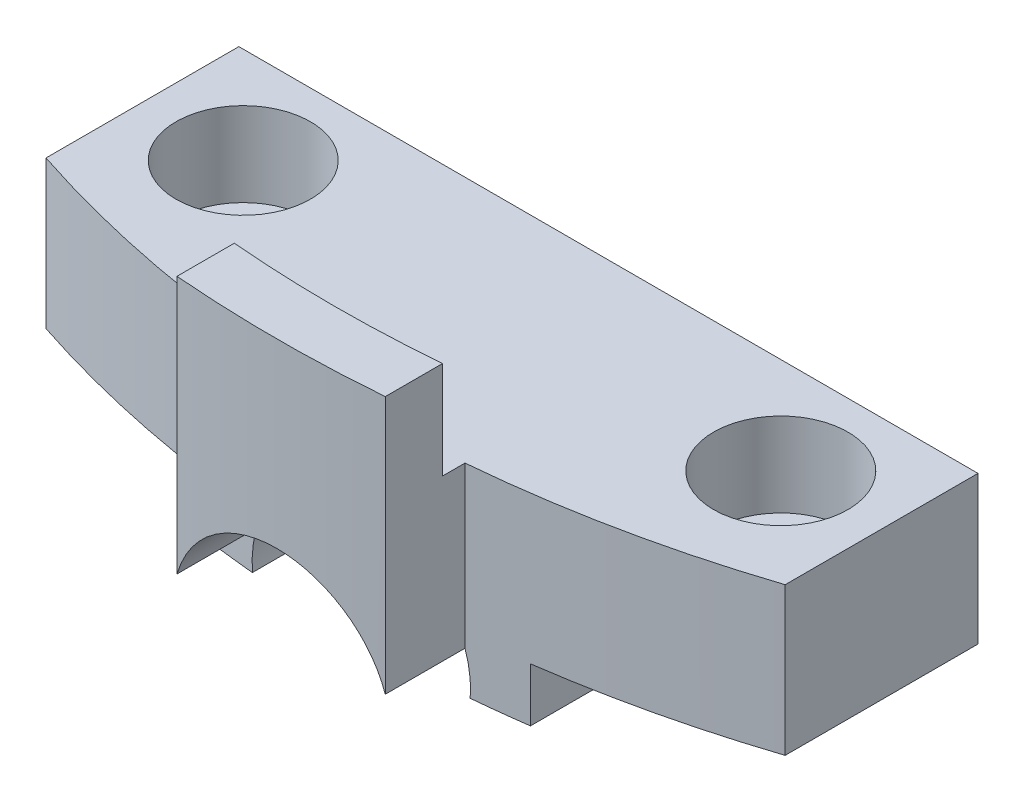
ISO-10303-21;
HEADER;
FILE_DESCRIPTION(('STEP AP214'),'2;1');
FILE_NAME('part.step','',(''),(''),'','','');
FILE_SCHEMA(('AUTOMOTIVE_DESIGN { 1 0 10303 214 1 1 1 1 }'));
ENDSEC;
DATA;
#1=APPLICATION_CONTEXT('core data for automotive mechanical design processes');
#2=APPLICATION_PROTOCOL_DEFINITION('international standard','automotive_design',2000,#1);
#3=PRODUCT_CONTEXT('',#1,'mechanical');
#4=PRODUCT('Part','Part','',(#3));
#5=PRODUCT_RELATED_PRODUCT_CATEGORY('part','',(#4));
#6=PRODUCT_DEFINITION_FORMATION('','',#4);
#7=PRODUCT_DEFINITION_CONTEXT('part definition',#1,'design');
#8=PRODUCT_DEFINITION('design','',#6,#7);
#9=PRODUCT_DEFINITION_SHAPE('','',#8);
#10=(LENGTH_UNIT() NAMED_UNIT(*) SI_UNIT(.MILLI.,.METRE.));
#11=(NAMED_UNIT(*) PLANE_ANGLE_UNIT() SI_UNIT($,.RADIAN.));
#12=(NAMED_UNIT(*) SI_UNIT($,.STERADIAN.) SOLID_ANGLE_UNIT());
#13=UNCERTAINTY_MEASURE_WITH_UNIT(LENGTH_MEASURE(1.E-05),#10,'distance_accuracy_value','');
#14=(GEOMETRIC_REPRESENTATION_CONTEXT(3) GLOBAL_UNCERTAINTY_ASSIGNED_CONTEXT((#13)) GLOBAL_UNIT_ASSIGNED_CONTEXT((#10,
#11,#12)) REPRESENTATION_CONTEXT('',''));
#15=CARTESIAN_POINT('',(0.,0.,0.));
#16=DIRECTION('',(0.,0.,1.));
#17=DIRECTION('',(1.,0.,0.));
#18=AXIS2_PLACEMENT_3D('',#15,#16,#17);
#19=CARTESIAN_POINT('',(0.,-1.6,0.));
#20=DIRECTION('',(0.,-1.,0.));
#21=DIRECTION('',(0.,0.,-1.));
#22=AXIS2_PLACEMENT_3D('',#19,#20,#21);
#23=PLANE('',#22);
#24=DIRECTION('',(0.,0.,-1.));
#25=VECTOR('',#24,1.);
#26=CARTESIAN_POINT('',(-3.24037034920393,-1.6,37.5));
#27=LINE('',#26,#25);
#28=CARTESIAN_POINT('',(-3.24037034920393,-1.6,34.9862615322072));
#29=VERTEX_POINT('',#28);
#30=CARTESIAN_POINT('',(-3.24037034920393,-1.6,27.630275757807));
#31=VERTEX_POINT('',#30);
#32=EDGE_CURVE('E11',#29,#31,#27,.T.);
#33=ORIENTED_EDGE('',*,*,#32,.F.);
#34=CARTESIAN_POINT('',(0.,-1.6,0.));
#35=DIRECTION('',(0.,-1.,0.));
#36=DIRECTION('',(0.,0.,-1.));
#37=AXIS2_PLACEMENT_3D('',#34,#35,#36);
#38=CIRCLE('',#37,35.136);
#39=CARTESIAN_POINT('',(-4.85,-1.6,34.7996551132335));
#40=VERTEX_POINT('',#39);
#41=EDGE_CURVE('E179',#29,#40,#38,.T.);
#42=ORIENTED_EDGE('',*,*,#41,.T.);
#43=DIRECTION('',(0.,0.,-1.));
#44=VECTOR('',#43,1.);
#45=CARTESIAN_POINT('',(-4.85,-1.6,34.7996551132335));
#46=LINE('',#45,#44);
#47=CARTESIAN_POINT('',(-4.85,-1.6,27.630275757807));
#48=VERTEX_POINT('',#47);
#49=EDGE_CURVE('E163',#40,#48,#46,.T.);
#50=ORIENTED_EDGE('',*,*,#49,.T.);
#51=DIRECTION('',(1.,0.,0.));
#52=VECTOR('',#51,1.);
#53=CARTESIAN_POINT('',(-4.85,-1.6,27.630275757807));
#54=LINE('',#53,#52);
#55=EDGE_CURVE('E157',#48,#31,#54,.T.);
#56=ORIENTED_EDGE('',*,*,#55,.T.);
#57=EDGE_LOOP('',(#33,#42,#50,#56));
#58=FACE_BOUND('',#57,.T.);
#59=ADVANCED_FACE('F36',(#58),#23,.T.);
#60=CARTESIAN_POINT('',(0.,0.,0.));
#61=DIRECTION('',(0.,-1.,0.));
#62=DIRECTION('',(0.,0.,-1.));
#63=AXIS2_PLACEMENT_3D('',#60,#61,#62);
#64=PLANE('',#63);
#65=DIRECTION('',(0.,0.,1.));
#66=VECTOR('',#65,1.);
#67=CARTESIAN_POINT('',(4.85,0.,34.7996551132335));
#68=LINE('',#67,#66);
#69=CARTESIAN_POINT('',(4.85,0.,27.630275757807));
#70=VERTEX_POINT('',#69);
#71=CARTESIAN_POINT('',(4.85,0.,34.7996551132335));
#72=VERTEX_POINT('',#71);
#73=EDGE_CURVE('E176',#70,#72,#68,.T.);
#74=ORIENTED_EDGE('',*,*,#73,.F.);
#75=DIRECTION('',(-1.,0.,0.));
#76=VECTOR('',#75,1.);
#77=CARTESIAN_POINT('',(-11.,0.,27.630275757807));
#78=LINE('',#77,#76);
#79=CARTESIAN_POINT('',(11.,0.,27.630275757807));
#80=VERTEX_POINT('',#79);
#81=EDGE_CURVE('E235',#80,#70,#78,.T.);
#82=ORIENTED_EDGE('',*,*,#81,.F.);
#83=DIRECTION('',(0.,0.,-1.));
#84=VECTOR('',#83,1.);
#85=CARTESIAN_POINT('',(11.,0.,27.630275757807));
#86=LINE('',#85,#84);
#87=CARTESIAN_POINT('',(11.,0.,33.369724242193));
#88=VERTEX_POINT('',#87);
#89=EDGE_CURVE('E254',#88,#80,#86,.T.);
#90=ORIENTED_EDGE('',*,*,#89,.F.);
#91=CARTESIAN_POINT('',(0.,0.,0.));
#92=DIRECTION('',(0.,1.,0.));
#93=DIRECTION('',(0.,0.,-1.));
#94=AXIS2_PLACEMENT_3D('',#91,#92,#93);
#95=CIRCLE('',#94,35.136);
#96=EDGE_CURVE('E252',#72,#88,#95,.T.);
#97=ORIENTED_EDGE('',*,*,#96,.F.);
#98=EDGE_LOOP('',(#74,#82,#90,#97));
#99=FACE_BOUND('',#98,.T.);
#100=CARTESIAN_POINT('',(8.,0.,30.5));
#101=DIRECTION('',(0.,1.,0.));
#102=DIRECTION('',(0.,0.,1.));
#103=AXIS2_PLACEMENT_3D('',#100,#101,#102);
#104=CIRCLE('',#103,1.1);
#105=CARTESIAN_POINT('',(8.,0.,31.6));
#106=VERTEX_POINT('',#105);
#107=EDGE_CURVE('E224',#106,#106,#104,.T.);
#108=ORIENTED_EDGE('',*,*,#107,.T.);
#109=EDGE_LOOP('',(#108));
#110=FACE_BOUND('',#109,.T.);
#111=ADVANCED_FACE('F309',(#99,#110),#64,.T.);
#112=CARTESIAN_POINT('',(-8.,4.4,30.5));
#113=DIRECTION('',(0.,-1.,0.));
#114=DIRECTION('',(0.,0.,-1.));
#115=AXIS2_PLACEMENT_3D('',#112,#113,#114);
#116=CYLINDRICAL_SURFACE('',#115,1.1);
#117=CARTESIAN_POINT('',(-8.,0.,30.5));
#118=DIRECTION('',(0.,1.,0.));
#119=DIRECTION('',(0.,0.,1.));
#120=AXIS2_PLACEMENT_3D('',#117,#118,#119);
#121=CIRCLE('',#120,1.1);
#122=CARTESIAN_POINT('',(-8.,0.,31.6));
#123=VERTEX_POINT('',#122);
#124=EDGE_CURVE('E227',#123,#123,#121,.T.);
#125=ORIENTED_EDGE('',*,*,#124,.F.);
#126=EDGE_LOOP('',(#125));
#127=FACE_BOUND('',#126,.T.);
#128=CARTESIAN_POINT('',(-8.,1.9,30.5));
#129=DIRECTION('',(0.,1.,0.));
#130=DIRECTION('',(0.,0.,1.));
#131=AXIS2_PLACEMENT_3D('',#128,#129,#130);
#132=CIRCLE('',#131,1.1);
#133=CARTESIAN_POINT('',(-8.,1.9,31.6));
#134=VERTEX_POINT('',#133);
#135=EDGE_CURVE('E218',#134,#134,#132,.T.);
#136=ORIENTED_EDGE('',*,*,#135,.T.);
#137=EDGE_LOOP('',(#136));
#138=FACE_BOUND('',#137,.T.);
#139=ADVANCED_FACE('F368',(#127,#138),#116,.F.);
#140=CARTESIAN_POINT('',(8.,4.4,30.5));
#141=DIRECTION('',(0.,-1.,0.));
#142=DIRECTION('',(0.,0.,-1.));
#143=AXIS2_PLACEMENT_3D('',#140,#141,#142);
#144=CYLINDRICAL_SURFACE('',#143,1.1);
#145=ORIENTED_EDGE('',*,*,#107,.F.);
#146=EDGE_LOOP('',(#145));
#147=FACE_BOUND('',#146,.T.);
#148=CARTESIAN_POINT('',(8.,1.9,30.5));
#149=DIRECTION('',(0.,1.,0.));
#150=DIRECTION('',(0.,0.,1.));
#151=AXIS2_PLACEMENT_3D('',#148,#149,#150);
#152=CIRCLE('',#151,1.1);
#153=CARTESIAN_POINT('',(8.,1.9,31.6));
#154=VERTEX_POINT('',#153);
#155=EDGE_CURVE('E194',#154,#154,#152,.T.);
#156=ORIENTED_EDGE('',*,*,#155,.T.);
#157=EDGE_LOOP('',(#156));
#158=FACE_BOUND('',#157,.T.);
#159=ADVANCED_FACE('F406',(#147,#158),#144,.F.);
#160=CARTESIAN_POINT('',(0.,4.4,0.));
#161=DIRECTION('',(0.,-1.,0.));
#162=DIRECTION('',(0.,0.,-1.));
#163=AXIS2_PLACEMENT_3D('',#160,#161,#162);
#164=PLANE('',#163);
#165=CARTESIAN_POINT('',(-8.,4.4,30.5));
#166=DIRECTION('',(0.,1.,0.));
#167=DIRECTION('',(0.,0.,1.));
#168=AXIS2_PLACEMENT_3D('',#165,#166,#167);
#169=CIRCLE('',#168,2.);
#170=CARTESIAN_POINT('',(-8.,4.4,32.5));
#171=VERTEX_POINT('',#170);
#172=EDGE_CURVE('E195',#171,#171,#169,.T.);
#173=ORIENTED_EDGE('',*,*,#172,.F.);
#174=EDGE_LOOP('',(#173));
#175=FACE_BOUND('',#174,.T.);
#176=CARTESIAN_POINT('',(8.,4.4,30.5));
#177=DIRECTION('',(0.,1.,0.));
#178=DIRECTION('',(0.,0.,1.));
#179=AXIS2_PLACEMENT_3D('',#176,#177,#178);
#180=CIRCLE('',#179,2.);
#181=CARTESIAN_POINT('',(8.,4.4,32.5));
#182=VERTEX_POINT('',#181);
#183=EDGE_CURVE('E190',#182,#182,#180,.T.);
#184=ORIENTED_EDGE('',*,*,#183,.F.);
#185=EDGE_LOOP('',(#184));
#186=FACE_BOUND('',#185,.T.);
#187=CARTESIAN_POINT('',(0.,4.4,0.));
#188=DIRECTION('',(0.,-1.,0.));
#189=DIRECTION('',(0.,0.,1.));
#190=AXIS2_PLACEMENT_3D('',#187,#188,#189);
#191=CIRCLE('',#190,35.8);
#192=CARTESIAN_POINT('',(3.1,4.4,35.6655295768898));
#193=VERTEX_POINT('',#192);
#194=CARTESIAN_POINT('',(-3.1,4.4,35.6655295768898));
#195=VERTEX_POINT('',#194);
#196=EDGE_CURVE('E207',#193,#195,#191,.T.);
#197=ORIENTED_EDGE('',*,*,#196,.F.);
#198=DIRECTION('',(0.,0.,-1.));
#199=VECTOR('',#198,1.);
#200=CARTESIAN_POINT('',(3.1,4.4,37.3716470067884));
#201=LINE('',#200,#199);
#202=CARTESIAN_POINT('',(3.09999999999999,4.4,34.9989784993791));
#203=VERTEX_POINT('',#202);
#204=EDGE_CURVE('E239',#193,#203,#201,.T.);
#205=ORIENTED_EDGE('',*,*,#204,.T.);
#206=CARTESIAN_POINT('',(0.,4.4,0.));
#207=DIRECTION('',(0.,1.,0.));
#208=DIRECTION('',(0.,0.,-1.));
#209=AXIS2_PLACEMENT_3D('',#206,#207,#208);
#210=CIRCLE('',#209,35.136);
#211=CARTESIAN_POINT('',(11.,4.4,33.369724242193));
#212=VERTEX_POINT('',#211);
#213=EDGE_CURVE('E241',#203,#212,#210,.T.);
#214=ORIENTED_EDGE('',*,*,#213,.T.);
#215=DIRECTION('',(0.,0.,-1.));
#216=VECTOR('',#215,1.);
#217=CARTESIAN_POINT('',(11.,4.4,27.630275757807));
#218=LINE('',#217,#216);
#219=CARTESIAN_POINT('',(11.,4.4,27.630275757807));
#220=VERTEX_POINT('',#219);
#221=EDGE_CURVE('E243',#212,#220,#218,.T.);
#222=ORIENTED_EDGE('',*,*,#221,.T.);
#223=DIRECTION('',(-1.,0.,0.));
#224=VECTOR('',#223,1.);
#225=CARTESIAN_POINT('',(-11.,4.4,27.630275757807));
#226=LINE('',#225,#224);
#227=CARTESIAN_POINT('',(-11.,4.4,27.630275757807));
#228=VERTEX_POINT('',#227);
#229=EDGE_CURVE('E245',#220,#228,#226,.T.);
#230=ORIENTED_EDGE('',*,*,#229,.T.);
#231=DIRECTION('',(0.,0.,1.));
#232=VECTOR('',#231,1.);
#233=CARTESIAN_POINT('',(-11.,4.4,27.630275757807));
#234=LINE('',#233,#232);
#235=CARTESIAN_POINT('',(-11.,4.4,33.369724242193));
#236=VERTEX_POINT('',#235);
#237=EDGE_CURVE('E231',#228,#236,#234,.T.);
#238=ORIENTED_EDGE('',*,*,#237,.T.);
#239=CARTESIAN_POINT('',(0.,4.4,0.));
#240=DIRECTION('',(0.,1.,0.));
#241=DIRECTION('',(0.,0.,-1.));
#242=AXIS2_PLACEMENT_3D('',#239,#240,#241);
#243=CIRCLE('',#242,35.136);
#244=CARTESIAN_POINT('',(-3.1,4.4,34.9989784993791));
#245=VERTEX_POINT('',#244);
#246=EDGE_CURVE('E234',#236,#245,#243,.T.);
#247=ORIENTED_EDGE('',*,*,#246,.T.);
#248=DIRECTION('',(0.,0.,1.));
#249=VECTOR('',#248,1.);
#250=CARTESIAN_POINT('',(-3.1,4.4,37.3716470067884));
#251=LINE('',#250,#249);
#252=EDGE_CURVE('E237',#245,#195,#251,.T.);
#253=ORIENTED_EDGE('',*,*,#252,.T.);
#254=EDGE_LOOP('',(#197,#205,#214,#222,#230,#238,#247,#253));
#255=FACE_BOUND('',#254,.T.);
#256=ADVANCED_FACE('F315',(#175,#186,#255),#164,.F.);
#257=DIRECTION('',(0.,0.,-1.));
#258=VECTOR('',#257,1.);
#259=CARTESIAN_POINT('',(-4.85,0.,34.7996551132335));
#260=LINE('',#259,#258);
#261=CARTESIAN_POINT('',(-4.85,0.,34.7996551132335));
#262=VERTEX_POINT('',#261);
#263=CARTESIAN_POINT('',(-4.85,0.,27.630275757807));
#264=VERTEX_POINT('',#263);
#265=EDGE_CURVE('E58',#262,#264,#260,.T.);
#266=ORIENTED_EDGE('',*,*,#265,.F.);
#267=CARTESIAN_POINT('',(0.,0.,0.));
#268=DIRECTION('',(0.,1.,0.));
#269=DIRECTION('',(0.,0.,-1.));
#270=AXIS2_PLACEMENT_3D('',#267,#268,#269);
#271=CIRCLE('',#270,35.136);
#272=CARTESIAN_POINT('',(-11.,0.,33.369724242193));
#273=VERTEX_POINT('',#272);
#274=EDGE_CURVE('E250',#273,#262,#271,.T.);
#275=ORIENTED_EDGE('',*,*,#274,.F.);
#276=DIRECTION('',(0.,0.,1.));
#277=VECTOR('',#276,1.);
#278=CARTESIAN_POINT('',(-11.,0.,27.630275757807));
#279=LINE('',#278,#277);
#280=CARTESIAN_POINT('',(-11.,0.,27.630275757807));
#281=VERTEX_POINT('',#280);
#282=EDGE_CURVE('E230',#281,#273,#279,.T.);
#283=ORIENTED_EDGE('',*,*,#282,.F.);
#284=EDGE_CURVE('E256',#264,#281,#78,.T.);
#285=ORIENTED_EDGE('',*,*,#284,.F.);
#286=EDGE_LOOP('',(#266,#275,#283,#285));
#287=FACE_BOUND('',#286,.T.);
#288=ORIENTED_EDGE('',*,*,#124,.T.);
#289=EDGE_LOOP('',(#288));
#290=FACE_BOUND('',#289,.T.);
#291=ADVANCED_FACE('F370',(#287,#290),#64,.T.);
#292=CARTESIAN_POINT('',(-11.,4.4,27.630275757807));
#293=DIRECTION('',(1.,0.,0.));
#294=DIRECTION('',(0.,0.,-1.));
#295=AXIS2_PLACEMENT_3D('',#292,#293,#294);
#296=PLANE('',#295);
#297=ORIENTED_EDGE('',*,*,#282,.T.);
#298=DIRECTION('',(0.,-1.,0.));
#299=VECTOR('',#298,1.);
#300=CARTESIAN_POINT('',(-11.,4.4,33.369724242193));
#301=LINE('',#300,#299);
#302=EDGE_CURVE('E279',#236,#273,#301,.T.);
#303=ORIENTED_EDGE('',*,*,#302,.F.);
#304=ORIENTED_EDGE('',*,*,#237,.F.);
#305=DIRECTION('',(0.,-1.,0.));
#306=VECTOR('',#305,1.);
#307=CARTESIAN_POINT('',(-11.,4.4,27.630275757807));
#308=LINE('',#307,#306);
#309=EDGE_CURVE('E247',#228,#281,#308,.T.);
#310=ORIENTED_EDGE('',*,*,#309,.T.);
#311=EDGE_LOOP('',(#297,#303,#304,#310));
#312=FACE_BOUND('',#311,.T.);
#313=ADVANCED_FACE('F38',(#312),#296,.F.);
#314=CARTESIAN_POINT('',(0.,4.4,0.));
#315=DIRECTION('',(0.,-1.,0.));
#316=DIRECTION('',(0.,0.,-1.));
#317=AXIS2_PLACEMENT_3D('',#314,#315,#316);
#318=CYLINDRICAL_SURFACE('',#317,35.136);
#319=ORIENTED_EDGE('',*,*,#41,.F.);
#320=CARTESIAN_POINT('',(-3.24037034920393,-1.6,34.9862615322072));
#321=CARTESIAN_POINT('',(-3.24838147449118,-1.49636718346636,34.9855152583489));
#322=CARTESIAN_POINT('',(-3.25138984980575,-1.39234811177976,34.985238156749));
#323=CARTESIAN_POINT('',(-3.24746138088606,-1.18544698879089,34.9856051664634));
#324=CARTESIAN_POINT('',(-3.24061480597139,-1.08256320571821,34.9862409161173));
#325=CARTESIAN_POINT('',(-3.21718022012195,-0.877921141327389,34.9884035445804));
#326=CARTESIAN_POINT('',(-3.20059223316633,-0.776162857239386,34.9899304211961));
#327=CARTESIAN_POINT('',(-3.15765501918185,-0.573765579114489,34.9938296575146));
#328=CARTESIAN_POINT('',(-3.13121753144742,-0.47314545151043,34.9962096544378));
#329=CARTESIAN_POINT('',(-3.09999999999999,-0.374038935202794,34.9989784993791));
#330=B_SPLINE_CURVE_WITH_KNOTS('',3,(#320,#321,#322,#323,#324,#325,#326,#327,#328,#329),
.UNSPECIFIED.,.F.,.F.,(4,2,2,2,4),(0.,0.311707817267455,0.620578559351616,0.929448541132698,
1.24115559652218),.UNSPECIFIED.);
#331=CARTESIAN_POINT('',(-3.1,-0.374038935202841,34.9989784993791));
#332=VERTEX_POINT('',#331);
#333=EDGE_CURVE('E148',#29,#332,#330,.T.);
#334=ORIENTED_EDGE('',*,*,#333,.T.);
#335=DIRECTION('',(0.,-1.,0.));
#336=VECTOR('',#335,1.);
#337=CARTESIAN_POINT('',(-3.1,4.4,34.9989784993791));
#338=LINE('',#337,#336);
#339=EDGE_CURVE('E276',#245,#332,#338,.T.);
#340=ORIENTED_EDGE('',*,*,#339,.F.);
#341=ORIENTED_EDGE('',*,*,#246,.F.);
#342=ORIENTED_EDGE('',*,*,#302,.T.);
#343=ORIENTED_EDGE('',*,*,#274,.T.);
#344=DIRECTION('',(0.,1.,0.));
#345=VECTOR('',#344,1.);
#346=CARTESIAN_POINT('',(-4.85,-1.6,34.7996551132335));
#347=LINE('',#346,#345);
#348=EDGE_CURVE('E187',#40,#262,#347,.T.);
#349=ORIENTED_EDGE('',*,*,#348,.F.);
#350=EDGE_LOOP('',(#319,#334,#340,#341,#342,#343,#349));
#351=FACE_BOUND('',#350,.T.);
#352=ADVANCED_FACE('F353',(#351),#318,.T.);
#353=CARTESIAN_POINT('',(-3.1,4.4,37.3716470067884));
#354=DIRECTION('',(1.,0.,0.));
#355=DIRECTION('',(0.,0.,-1.));
#356=AXIS2_PLACEMENT_3D('',#353,#354,#355);
#357=PLANE('',#356);
#358=ORIENTED_EDGE('',*,*,#339,.T.);
#359=DIRECTION('',(0.,0.,-1.));
#360=VECTOR('',#359,1.);
#361=CARTESIAN_POINT('',(-3.1,-0.374038935202841,37.5));
#362=LINE('',#361,#360);
#363=CARTESIAN_POINT('',(-3.09999999999999,-0.374038935202799,37.3716470067884));
#364=VERTEX_POINT('',#363);
#365=EDGE_CURVE('E324',#332,#364,#362,.F.);
#366=ORIENTED_EDGE('',*,*,#365,.T.);
#367=DIRECTION('',(0.,-1.,0.));
#368=VECTOR('',#367,1.);
#369=CARTESIAN_POINT('',(-3.1,4.4,37.3716470067884));
#370=LINE('',#369,#368);
#371=CARTESIAN_POINT('',(-3.1,7.3,37.3716470067884));
#372=VERTEX_POINT('',#371);
#373=EDGE_CURVE('E273',#372,#364,#370,.T.);
#374=ORIENTED_EDGE('',*,*,#373,.F.);
#375=DIRECTION('',(0.,0.,1.));
#376=VECTOR('',#375,1.);
#377=CARTESIAN_POINT('',(-3.1,7.3,35.6655295768898));
#378=LINE('',#377,#376);
#379=CARTESIAN_POINT('',(-3.1,7.3,35.6655295768898));
#380=VERTEX_POINT('',#379);
#381=EDGE_CURVE('E206',#380,#372,#378,.T.);
#382=ORIENTED_EDGE('',*,*,#381,.F.);
#383=DIRECTION('',(0.,-1.,0.));
#384=VECTOR('',#383,1.);
#385=CARTESIAN_POINT('',(-3.1,7.3,35.6655295768898));
#386=LINE('',#385,#384);
#387=EDGE_CURVE('E221',#380,#195,#386,.T.);
#388=ORIENTED_EDGE('',*,*,#387,.T.);
#389=ORIENTED_EDGE('',*,*,#252,.F.);
#390=EDGE_LOOP('',(#358,#366,#374,#382,#388,#389));
#391=FACE_BOUND('',#390,.T.);
#392=ADVANCED_FACE('F356',(#391),#357,.F.);
#393=CARTESIAN_POINT('',(0.,4.4,0.));
#394=DIRECTION('',(0.,-1.,0.));
#395=DIRECTION('',(0.,0.,-1.));
#396=AXIS2_PLACEMENT_3D('',#393,#394,#395);
#397=CYLINDRICAL_SURFACE('',#396,37.5);
#398=ORIENTED_EDGE('',*,*,#373,.T.);
#399=CARTESIAN_POINT('',(-3.09999999999999,-0.374038935202799,37.3716470067884));
#400=CARTESIAN_POINT('',(-3.07254779406441,-0.286811822106101,37.3739224755368));
#401=CARTESIAN_POINT('',(-3.04140114829006,-0.200760202351265,37.3764773334932));
#402=CARTESIAN_POINT('',(-2.97198147028764,-0.031603381057832,37.3820621753399));
#403=CARTESIAN_POINT('',(-2.93370890431418,0.0515020128313894,37.3850921281422));
#404=CARTESIAN_POINT('',(-2.85032758385757,0.214121346343119,37.3915414008008));
#405=CARTESIAN_POINT('',(-2.80522399196994,0.293637939812438,37.3949604261316));
#406=CARTESIAN_POINT('',(-2.70850812387896,0.448564575219114,37.4020900381524));
#407=CARTESIAN_POINT('',(-2.65689589388932,0.52397464630884,37.4058006227721));
#408=CARTESIAN_POINT('',(-2.49276557621703,0.743297340588614,37.4172170773112));
#409=CARTESIAN_POINT('',(-2.37091198372302,0.880383928116417,37.4252110385129));
#410=CARTESIAN_POINT('',(-2.10600678764599,1.1320674826719,37.4410510447975));
#411=CARTESIAN_POINT('',(-1.96295872366116,1.24666819755547,37.4488971143331));
#412=CARTESIAN_POINT('',(-1.65941673182277,1.45040471797345,37.4635744507601));
#413=CARTESIAN_POINT('',(-1.49890158319284,1.53950906024902,37.4704044588576));
#414=CARTESIAN_POINT('',(-1.16510253025829,1.68949440456298,37.4822678222393));
#415=CARTESIAN_POINT('',(-0.991816975509129,1.75037175111095,37.4873009448013));
#416=CARTESIAN_POINT('',(-0.637830685899814,1.84202434952438,37.4949919566228));
#417=CARTESIAN_POINT('',(-0.457147831971588,1.8728681848497,37.4976552563203));
#418=CARTESIAN_POINT('',(-0.0931627251724879,1.90379440409058,37.5003257717897));
#419=CARTESIAN_POINT('',(0.0901393048123696,1.90387939010773,37.5003332122389));
#420=CARTESIAN_POINT('',(0.453612397954125,1.87333716914913,37.4976956572453));
#421=CARTESIAN_POINT('',(0.633790955269817,1.84279837343865,37.4950582973752));
#422=CARTESIAN_POINT('',(0.986454665277773,1.75202522449514,37.4874383544059));
#423=CARTESIAN_POINT('',(1.15893969720728,1.69179040531208,37.482455734508));
#424=CARTESIAN_POINT('',(1.49149911547903,1.54328955461882,37.4706974624996));
#425=CARTESIAN_POINT('',(1.65156253465671,1.45499909509753,37.463920248699));
#426=CARTESIAN_POINT('',(1.95465299781571,1.2528849210708,37.4493309792825));
#427=CARTESIAN_POINT('',(2.09767715540833,1.13905688998304,37.4415187488107));
#428=CARTESIAN_POINT('',(2.36314468440859,0.88863484205875,37.425704179863));
#429=CARTESIAN_POINT('',(2.48550938051013,0.751957573689869,37.4177012414678));
#430=CARTESIAN_POINT('',(2.70549164357445,0.460012323993601,37.4024398189215));
#431=CARTESIAN_POINT('',(2.80313187949867,0.304761565779923,37.3951806564923));
#432=CARTESIAN_POINT('',(2.92987381825662,0.0596395134927391,37.3853939928706));
#433=CARTESIAN_POINT('',(2.96914764656425,-0.0250934252473997,37.382288122178));
#434=CARTESIAN_POINT('',(3.04020927797019,-0.197482628681803,37.3765750960585));
#435=CARTESIAN_POINT('',(3.07201022161347,-0.285133447784629,37.3739670667517));
#436=CARTESIAN_POINT('',(3.1,-0.374038935202827,37.3716470067884));
#437=B_SPLINE_CURVE_WITH_KNOTS('',3,(#399,#400,#401,#402,#403,#404,#405,#406,#407,#408,#409,
#410,#411,#412,#413,#414,#415,#416,#417,#418,#419,#420,#421,#422,#423,#424,#425,#426,#427,#428,
#429,#430,#431,#432,#433,#434,#435,#436),.UNSPECIFIED.,.F.,.F.,(4,2,2,2,2,2,2,2,2,2,2,2,2,2,2,2,
2,2,4),(0.,0.274329298979116,0.548640654679056,0.822745722729152,1.09684884464251,
1.64478351681073,2.19262678367981,2.74114321773539,3.28973066667867,3.8370624222524,
4.38434787527598,4.93005784377367,5.47577637509011,6.02197137084923,6.56825875888399,
7.11658175710863,7.66440018252418,7.94442922613324,8.22396211059117),.UNSPECIFIED.);
#438=CARTESIAN_POINT('',(3.1,-0.374038935202841,37.3716470067884));
#439=VERTEX_POINT('',#438);
#440=EDGE_CURVE('E322',#364,#439,#437,.T.);
#441=ORIENTED_EDGE('',*,*,#440,.T.);
#442=DIRECTION('',(0.,-1.,0.));
#443=VECTOR('',#442,1.);
#444=CARTESIAN_POINT('',(3.1,4.4,37.3716470067884));
#445=LINE('',#444,#443);
#446=CARTESIAN_POINT('',(3.09999999999999,7.3,37.3716470067884));
#447=VERTEX_POINT('',#446);
#448=EDGE_CURVE('E270',#447,#439,#445,.T.);
#449=ORIENTED_EDGE('',*,*,#448,.F.);
#450=CARTESIAN_POINT('',(0.,7.3,0.));
#451=DIRECTION('',(0.,1.,0.));
#452=DIRECTION('',(0.,0.,1.));
#453=AXIS2_PLACEMENT_3D('',#450,#451,#452);
#454=CIRCLE('',#453,37.5);
#455=EDGE_CURVE('E210',#372,#447,#454,.T.);
#456=ORIENTED_EDGE('',*,*,#455,.F.);
#457=EDGE_LOOP('',(#398,#441,#449,#456));
#458=FACE_BOUND('',#457,.T.);
#459=ADVANCED_FACE('F339',(#458),#397,.T.);
#460=CARTESIAN_POINT('',(3.1,4.4,37.3716470067884));
#461=DIRECTION('',(-1.,0.,0.));
#462=DIRECTION('',(0.,0.,1.));
#463=AXIS2_PLACEMENT_3D('',#460,#461,#462);
#464=PLANE('',#463);
#465=ORIENTED_EDGE('',*,*,#448,.T.);
#466=DIRECTION('',(0.,0.,-1.));
#467=VECTOR('',#466,1.);
#468=CARTESIAN_POINT('',(3.1,-0.374038935202841,37.5));
#469=LINE('',#468,#467);
#470=CARTESIAN_POINT('',(3.09999999999999,-0.374038935202823,34.9989784993791));
#471=VERTEX_POINT('',#470);
#472=EDGE_CURVE('E294',#439,#471,#469,.T.);
#473=ORIENTED_EDGE('',*,*,#472,.T.);
#474=DIRECTION('',(0.,-1.,0.));
#475=VECTOR('',#474,1.);
#476=CARTESIAN_POINT('',(3.09999999999999,4.4,34.9989784993791));
#477=LINE('',#476,#475);
#478=EDGE_CURVE('E267',#203,#471,#477,.T.);
#479=ORIENTED_EDGE('',*,*,#478,.F.);
#480=ORIENTED_EDGE('',*,*,#204,.F.);
#481=DIRECTION('',(0.,-1.,0.));
#482=VECTOR('',#481,1.);
#483=CARTESIAN_POINT('',(3.1,7.3,35.6655295768898));
#484=LINE('',#483,#482);
#485=CARTESIAN_POINT('',(3.1,7.3,35.6655295768898));
#486=VERTEX_POINT('',#485);
#487=EDGE_CURVE('E215',#486,#193,#484,.T.);
#488=ORIENTED_EDGE('',*,*,#487,.F.);
#489=DIRECTION('',(0.,0.,-1.));
#490=VECTOR('',#489,1.);
#491=CARTESIAN_POINT('',(3.1,7.3,37.3716470067884));
#492=LINE('',#491,#490);
#493=EDGE_CURVE('E213',#447,#486,#492,.T.);
#494=ORIENTED_EDGE('',*,*,#493,.F.);
#495=EDGE_LOOP('',(#465,#473,#479,#480,#488,#494));
#496=FACE_BOUND('',#495,.T.);
#497=ADVANCED_FACE('F320',(#496),#464,.F.);
#498=CARTESIAN_POINT('',(0.,4.4,0.));
#499=DIRECTION('',(0.,-1.,0.));
#500=DIRECTION('',(0.,0.,-1.));
#501=AXIS2_PLACEMENT_3D('',#498,#499,#500);
#502=CYLINDRICAL_SURFACE('',#501,35.136);
#503=ORIENTED_EDGE('',*,*,#478,.T.);
#504=CARTESIAN_POINT('',(3.09999999999999,-0.374038935202823,34.9989784993791));
#505=CARTESIAN_POINT('',(3.13121753144742,-0.473145451510457,34.9962096544378));
#506=CARTESIAN_POINT('',(3.15765501918186,-0.573765579114513,34.9938296575146));
#507=CARTESIAN_POINT('',(3.20059223316634,-0.776162857239405,34.9899304211961));
#508=CARTESIAN_POINT('',(3.21718022012195,-0.877921141327406,34.9884035445804));
#509=CARTESIAN_POINT('',(3.24061480597139,-1.08256320571822,34.9862409161173));
#510=CARTESIAN_POINT('',(3.24746138088606,-1.1854469887909,34.9856051664634));
#511=CARTESIAN_POINT('',(3.25138984980575,-1.39234811177977,34.985238156749));
#512=CARTESIAN_POINT('',(3.24838147449118,-1.49636718346636,34.9855152583489));
#513=CARTESIAN_POINT('',(3.24037034920393,-1.6,34.9862615322072));
#514=B_SPLINE_CURVE_WITH_KNOTS('',3,(#504,#505,#506,#507,#508,#509,#510,#511,#512,#513),
.UNSPECIFIED.,.F.,.F.,(4,2,2,2,4),(0.,0.311707055389471,0.620577037170546,0.9294477792547,
1.24115559652215),.UNSPECIFIED.);
#515=CARTESIAN_POINT('',(3.24037034920393,-1.6,34.9862615322072));
#516=VERTEX_POINT('',#515);
#517=EDGE_CURVE('E160',#471,#516,#514,.T.);
#518=ORIENTED_EDGE('',*,*,#517,.T.);
#519=CARTESIAN_POINT('',(0.,-1.6,0.));
#520=DIRECTION('',(0.,-1.,0.));
#521=DIRECTION('',(0.,0.,-1.));
#522=AXIS2_PLACEMENT_3D('',#519,#520,#521);
#523=CIRCLE('',#522,35.136);
#524=CARTESIAN_POINT('',(4.85,-1.6,34.7996551132335));
#525=VERTEX_POINT('',#524);
#526=EDGE_CURVE('E167',#525,#516,#523,.T.);
#527=ORIENTED_EDGE('',*,*,#526,.F.);
#528=DIRECTION('',(0.,1.,0.));
#529=VECTOR('',#528,1.);
#530=CARTESIAN_POINT('',(4.85,-1.6,34.7996551132335));
#531=LINE('',#530,#529);
#532=EDGE_CURVE('E174',#525,#72,#531,.T.);
#533=ORIENTED_EDGE('',*,*,#532,.T.);
#534=ORIENTED_EDGE('',*,*,#96,.T.);
#535=DIRECTION('',(0.,-1.,0.));
#536=VECTOR('',#535,1.);
#537=CARTESIAN_POINT('',(11.,4.4,33.369724242193));
#538=LINE('',#537,#536);
#539=EDGE_CURVE('E264',#212,#88,#538,.T.);
#540=ORIENTED_EDGE('',*,*,#539,.F.);
#541=ORIENTED_EDGE('',*,*,#213,.F.);
#542=EDGE_LOOP('',(#503,#518,#527,#533,#534,#540,#541));
#543=FACE_BOUND('',#542,.T.);
#544=ADVANCED_FACE('F291',(#543),#502,.T.);
#545=CARTESIAN_POINT('',(11.,4.4,27.630275757807));
#546=DIRECTION('',(-1.,0.,0.));
#547=DIRECTION('',(0.,0.,1.));
#548=AXIS2_PLACEMENT_3D('',#545,#546,#547);
#549=PLANE('',#548);
#550=ORIENTED_EDGE('',*,*,#89,.T.);
#551=DIRECTION('',(0.,-1.,0.));
#552=VECTOR('',#551,1.);
#553=CARTESIAN_POINT('',(11.,4.4,27.630275757807));
#554=LINE('',#553,#552);
#555=EDGE_CURVE('E261',#220,#80,#554,.T.);
#556=ORIENTED_EDGE('',*,*,#555,.F.);
#557=ORIENTED_EDGE('',*,*,#221,.F.);
#558=ORIENTED_EDGE('',*,*,#539,.T.);
#559=EDGE_LOOP('',(#550,#556,#557,#558));
#560=FACE_BOUND('',#559,.T.);
#561=ADVANCED_FACE('F306',(#560),#549,.F.);
#562=CARTESIAN_POINT('',(-11.,4.4,27.630275757807));
#563=DIRECTION('',(0.,0.,1.));
#564=DIRECTION('',(1.,0.,0.));
#565=AXIS2_PLACEMENT_3D('',#562,#563,#564);
#566=PLANE('',#565);
#567=CARTESIAN_POINT('',(3.24037034920393,-1.6,27.630275757807));
#568=VERTEX_POINT('',#567);
#569=CARTESIAN_POINT('',(4.85,-1.6,27.630275757807));
#570=VERTEX_POINT('',#569);
#571=EDGE_CURVE('E159',#568,#570,#54,.T.);
#572=ORIENTED_EDGE('',*,*,#571,.F.);
#573=CARTESIAN_POINT('',(0.,-1.35,27.630275757807));
#574=DIRECTION('',(0.,0.,-1.));
#575=DIRECTION('',(-1.,0.,0.));
#576=AXIS2_PLACEMENT_3D('',#573,#574,#575);
#577=CIRCLE('',#576,3.25);
#578=EDGE_CURVE('E50',#31,#568,#577,.T.);
#579=ORIENTED_EDGE('',*,*,#578,.F.);
#580=ORIENTED_EDGE('',*,*,#55,.F.);
#581=DIRECTION('',(0.,1.,0.));
#582=VECTOR('',#581,1.);
#583=CARTESIAN_POINT('',(-4.85,-1.6,27.630275757807));
#584=LINE('',#583,#582);
#585=EDGE_CURVE('E185',#48,#264,#584,.T.);
#586=ORIENTED_EDGE('',*,*,#585,.T.);
#587=ORIENTED_EDGE('',*,*,#284,.T.);
#588=ORIENTED_EDGE('',*,*,#309,.F.);
#589=ORIENTED_EDGE('',*,*,#229,.F.);
#590=ORIENTED_EDGE('',*,*,#555,.T.);
#591=ORIENTED_EDGE('',*,*,#81,.T.);
#592=DIRECTION('',(0.,1.,0.));
#593=VECTOR('',#592,1.);
#594=CARTESIAN_POINT('',(4.85,-1.6,27.630275757807));
#595=LINE('',#594,#593);
#596=EDGE_CURVE('E182',#570,#70,#595,.T.);
#597=ORIENTED_EDGE('',*,*,#596,.F.);
#598=EDGE_LOOP('',(#572,#579,#580,#586,#587,#588,#589,#590,#591,#597));
#599=FACE_BOUND('',#598,.T.);
#600=ADVANCED_FACE('F155',(#599),#566,.F.);
#601=CARTESIAN_POINT('',(0.,7.3,0.));
#602=DIRECTION('',(0.,-1.,0.));
#603=DIRECTION('',(0.,0.,-1.));
#604=AXIS2_PLACEMENT_3D('',#601,#602,#603);
#605=CYLINDRICAL_SURFACE('',#604,35.8);
#606=ORIENTED_EDGE('',*,*,#196,.T.);
#607=ORIENTED_EDGE('',*,*,#387,.F.);
#608=CARTESIAN_POINT('',(0.,7.3,0.));
#609=DIRECTION('',(0.,-1.,0.));
#610=DIRECTION('',(0.,0.,1.));
#611=AXIS2_PLACEMENT_3D('',#608,#609,#610);
#612=CIRCLE('',#611,35.8);
#613=EDGE_CURVE('E203',#486,#380,#612,.T.);
#614=ORIENTED_EDGE('',*,*,#613,.F.);
#615=ORIENTED_EDGE('',*,*,#487,.T.);
#616=EDGE_LOOP('',(#606,#607,#614,#615));
#617=FACE_BOUND('',#616,.T.);
#618=ADVANCED_FACE('F401',(#617),#605,.F.);
#619=CARTESIAN_POINT('',(0.,7.3,0.));
#620=DIRECTION('',(0.,1.,0.));
#621=DIRECTION('',(0.,0.,1.));
#622=AXIS2_PLACEMENT_3D('',#619,#620,#621);
#623=PLANE('',#622);
#624=ORIENTED_EDGE('',*,*,#613,.T.);
#625=ORIENTED_EDGE('',*,*,#381,.T.);
#626=ORIENTED_EDGE('',*,*,#455,.T.);
#627=ORIENTED_EDGE('',*,*,#493,.T.);
#628=EDGE_LOOP('',(#624,#625,#626,#627));
#629=FACE_BOUND('',#628,.T.);
#630=ADVANCED_FACE('F397',(#629),#623,.T.);
#631=CARTESIAN_POINT('',(8.,1.9,30.5));
#632=DIRECTION('',(0.,1.,0.));
#633=DIRECTION('',(0.,0.,1.));
#634=AXIS2_PLACEMENT_3D('',#631,#632,#633);
#635=CYLINDRICAL_SURFACE('',#634,2.);
#636=CARTESIAN_POINT('',(8.,1.9,30.5));
#637=DIRECTION('',(0.,1.,0.));
#638=DIRECTION('',(0.,0.,1.));
#639=AXIS2_PLACEMENT_3D('',#636,#637,#638);
#640=CIRCLE('',#639,2.);
#641=CARTESIAN_POINT('',(8.,1.9,32.5));
#642=VERTEX_POINT('',#641);
#643=EDGE_CURVE('E198',#642,#642,#640,.T.);
#644=ORIENTED_EDGE('',*,*,#643,.F.);
#645=EDGE_LOOP('',(#644));
#646=FACE_BOUND('',#645,.T.);
#647=ORIENTED_EDGE('',*,*,#183,.T.);
#648=EDGE_LOOP('',(#647));
#649=FACE_BOUND('',#648,.T.);
#650=ADVANCED_FACE('F393',(#646,#649),#635,.F.);
#651=CARTESIAN_POINT('',(8.,1.9,30.5));
#652=DIRECTION('',(0.,1.,0.));
#653=DIRECTION('',(0.,0.,1.));
#654=AXIS2_PLACEMENT_3D('',#651,#652,#653);
#655=PLANE('',#654);
#656=ORIENTED_EDGE('',*,*,#155,.F.);
#657=EDGE_LOOP('',(#656));
#658=FACE_BOUND('',#657,.T.);
#659=ORIENTED_EDGE('',*,*,#643,.T.);
#660=EDGE_LOOP('',(#659));
#661=FACE_BOUND('',#660,.T.);
#662=ADVANCED_FACE('F389',(#658,#661),#655,.T.);
#663=CARTESIAN_POINT('',(-8.,1.9,30.5));
#664=DIRECTION('',(0.,1.,0.));
#665=DIRECTION('',(0.,0.,1.));
#666=AXIS2_PLACEMENT_3D('',#663,#664,#665);
#667=CYLINDRICAL_SURFACE('',#666,2.);
#668=CARTESIAN_POINT('',(-8.,1.9,30.5));
#669=DIRECTION('',(0.,1.,0.));
#670=DIRECTION('',(0.,0.,1.));
#671=AXIS2_PLACEMENT_3D('',#668,#669,#670);
#672=CIRCLE('',#671,2.);
#673=CARTESIAN_POINT('',(-8.,1.9,32.5));
#674=VERTEX_POINT('',#673);
#675=EDGE_CURVE('E191',#674,#674,#672,.T.);
#676=ORIENTED_EDGE('',*,*,#675,.F.);
#677=EDGE_LOOP('',(#676));
#678=FACE_BOUND('',#677,.T.);
#679=ORIENTED_EDGE('',*,*,#172,.T.);
#680=EDGE_LOOP('',(#679));
#681=FACE_BOUND('',#680,.T.);
#682=ADVANCED_FACE('F385',(#678,#681),#667,.F.);
#683=CARTESIAN_POINT('',(-8.,1.9,30.5));
#684=DIRECTION('',(0.,1.,0.));
#685=DIRECTION('',(0.,0.,1.));
#686=AXIS2_PLACEMENT_3D('',#683,#684,#685);
#687=PLANE('',#686);
#688=ORIENTED_EDGE('',*,*,#135,.F.);
#689=EDGE_LOOP('',(#688));
#690=FACE_BOUND('',#689,.T.);
#691=ORIENTED_EDGE('',*,*,#675,.T.);
#692=EDGE_LOOP('',(#691));
#693=FACE_BOUND('',#692,.T.);
#694=ADVANCED_FACE('F379',(#690,#693),#687,.T.);
#695=CARTESIAN_POINT('',(-4.85,-1.6,34.7996551132335));
#696=DIRECTION('',(1.,0.,0.));
#697=DIRECTION('',(0.,0.,-1.));
#698=AXIS2_PLACEMENT_3D('',#695,#696,#697);
#699=PLANE('',#698);
#700=ORIENTED_EDGE('',*,*,#265,.T.);
#701=ORIENTED_EDGE('',*,*,#585,.F.);
#702=ORIENTED_EDGE('',*,*,#49,.F.);
#703=ORIENTED_EDGE('',*,*,#348,.T.);
#704=EDGE_LOOP('',(#700,#701,#702,#703));
#705=FACE_BOUND('',#704,.T.);
#706=ADVANCED_FACE('F375',(#705),#699,.F.);
#707=CARTESIAN_POINT('',(4.85,-1.6,34.7996551132335));
#708=DIRECTION('',(-1.,0.,0.));
#709=DIRECTION('',(0.,0.,1.));
#710=AXIS2_PLACEMENT_3D('',#707,#708,#709);
#711=PLANE('',#710);
#712=ORIENTED_EDGE('',*,*,#73,.T.);
#713=ORIENTED_EDGE('',*,*,#532,.F.);
#714=DIRECTION('',(0.,0.,1.));
#715=VECTOR('',#714,1.);
#716=CARTESIAN_POINT('',(4.85,-1.6,34.7996551132335));
#717=LINE('',#716,#715);
#718=EDGE_CURVE('E165',#570,#525,#717,.T.);
#719=ORIENTED_EDGE('',*,*,#718,.F.);
#720=ORIENTED_EDGE('',*,*,#596,.T.);
#721=EDGE_LOOP('',(#712,#713,#719,#720));
#722=FACE_BOUND('',#721,.T.);
#723=ADVANCED_FACE('F300',(#722),#711,.F.);
#724=DIRECTION('',(0.,0.,-1.));
#725=VECTOR('',#724,1.);
#726=CARTESIAN_POINT('',(3.24037034920393,-1.6,37.5));
#727=LINE('',#726,#725);
#728=EDGE_CURVE('E44',#568,#516,#727,.F.);
#729=ORIENTED_EDGE('',*,*,#728,.F.);
#730=ORIENTED_EDGE('',*,*,#571,.T.);
#731=ORIENTED_EDGE('',*,*,#718,.T.);
#732=ORIENTED_EDGE('',*,*,#526,.T.);
#733=EDGE_LOOP('',(#729,#730,#731,#732));
#734=FACE_BOUND('',#733,.T.);
#735=ADVANCED_FACE('F296',(#734),#23,.T.);
#736=CARTESIAN_POINT('',(0.,-1.35,37.5));
#737=DIRECTION('',(0.,0.,-1.));
#738=DIRECTION('',(-1.,0.,0.));
#739=AXIS2_PLACEMENT_3D('',#736,#737,#738);
#740=CYLINDRICAL_SURFACE('',#739,3.25);
#741=ORIENTED_EDGE('',*,*,#32,.T.);
#742=ORIENTED_EDGE('',*,*,#578,.T.);
#743=ORIENTED_EDGE('',*,*,#728,.T.);
#744=ORIENTED_EDGE('',*,*,#517,.F.);
#745=ORIENTED_EDGE('',*,*,#472,.F.);
#746=ORIENTED_EDGE('',*,*,#440,.F.);
#747=ORIENTED_EDGE('',*,*,#365,.F.);
#748=ORIENTED_EDGE('',*,*,#333,.F.);
#749=EDGE_LOOP('',(#741,#742,#743,#744,#745,#746,#747,#748));
#750=FACE_BOUND('',#749,.T.);
#751=ADVANCED_FACE('F146',(#750),#740,.F.);
#752=CLOSED_SHELL('',(#59,#111,#139,#159,#256,#291,#313,#352,#392,#459,#497,#544,#561,#600,#618,
#630,#650,#662,#682,#694,#706,#723,#735,#751));
#753=MANIFOLD_SOLID_BREP('B2',#752);
#754=ADVANCED_BREP_SHAPE_REPRESENTATION('',(#18,#753),#14);
#755=SHAPE_DEFINITION_REPRESENTATION(#9,#754);
ENDSEC;
END-ISO-10303-21;
